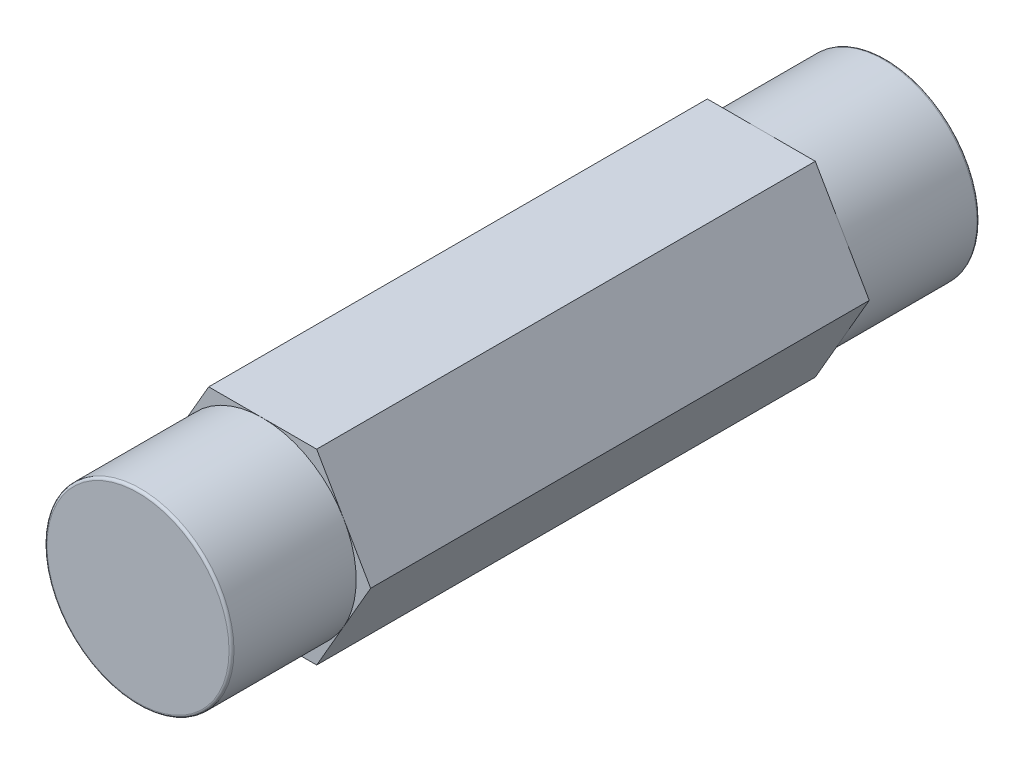
ISO-10303-21;
HEADER;
FILE_DESCRIPTION(('STEP AP214'),'2;1');
FILE_NAME('part.step','',(''),(''),'','','');
FILE_SCHEMA(('AUTOMOTIVE_DESIGN { 1 0 10303 214 1 1 1 1 }'));
ENDSEC;
DATA;
#1=APPLICATION_CONTEXT('core data for automotive mechanical design processes');
#2=APPLICATION_PROTOCOL_DEFINITION('international standard','automotive_design',2000,#1);
#3=PRODUCT_CONTEXT('',#1,'mechanical');
#4=PRODUCT('Part','Part','',(#3));
#5=PRODUCT_RELATED_PRODUCT_CATEGORY('part','',(#4));
#6=PRODUCT_DEFINITION_FORMATION('','',#4);
#7=PRODUCT_DEFINITION_CONTEXT('part definition',#1,'design');
#8=PRODUCT_DEFINITION('design','',#6,#7);
#9=PRODUCT_DEFINITION_SHAPE('','',#8);
#10=(LENGTH_UNIT() NAMED_UNIT(*) SI_UNIT(.MILLI.,.METRE.));
#11=(NAMED_UNIT(*) PLANE_ANGLE_UNIT() SI_UNIT($,.RADIAN.));
#12=(NAMED_UNIT(*) SI_UNIT($,.STERADIAN.) SOLID_ANGLE_UNIT());
#13=UNCERTAINTY_MEASURE_WITH_UNIT(LENGTH_MEASURE(1.E-05),#10,'distance_accuracy_value','');
#14=(GEOMETRIC_REPRESENTATION_CONTEXT(3) GLOBAL_UNCERTAINTY_ASSIGNED_CONTEXT((#13)) GLOBAL_UNIT_ASSIGNED_CONTEXT((#10,
#11,#12)) REPRESENTATION_CONTEXT('',''));
#15=CARTESIAN_POINT('',(0.,0.,0.));
#16=DIRECTION('',(0.,0.,1.));
#17=DIRECTION('',(1.,0.,0.));
#18=AXIS2_PLACEMENT_3D('',#15,#16,#17);
#19=CARTESIAN_POINT('',(5.49926131403119,0.,38.1));
#20=DIRECTION('',(0.,0.,1.));
#21=DIRECTION('',(1.,0.,0.));
#22=AXIS2_PLACEMENT_3D('',#19,#20,#21);
#23=PLANE('',#22);
#24=CARTESIAN_POINT('',(0.,0.,38.1));
#25=DIRECTION('',(0.,0.,-1.));
#26=DIRECTION('',(-1.,0.,0.));
#27=AXIS2_PLACEMENT_3D('',#24,#25,#26);
#28=CIRCLE('',#27,4.6355);
#29=CARTESIAN_POINT('',(-4.6355,0.,38.1));
#30=VERTEX_POINT('',#29);
#31=CARTESIAN_POINT('',(4.6355,0.,38.1));
#32=VERTEX_POINT('',#31);
#33=EDGE_CURVE('E238',#30,#32,#28,.T.);
#34=ORIENTED_EDGE('',*,*,#33,.F.);
#35=CARTESIAN_POINT('',(0.,0.,38.1));
#36=DIRECTION('',(0.,0.,-1.));
#37=DIRECTION('',(1.,0.,0.));
#38=AXIS2_PLACEMENT_3D('',#35,#36,#37);
#39=CIRCLE('',#38,4.6355);
#40=EDGE_CURVE('E241',#32,#30,#39,.T.);
#41=ORIENTED_EDGE('',*,*,#40,.F.);
#42=EDGE_LOOP('',(#34,#41));
#43=FACE_BOUND('',#42,.T.);
#44=ADVANCED_FACE('F16',(#43),#23,.T.);
#45=CARTESIAN_POINT('',(5.49926131403119,0.,0.));
#46=DIRECTION('',(0.,0.,1.));
#47=DIRECTION('',(1.,0.,0.));
#48=AXIS2_PLACEMENT_3D('',#45,#46,#47);
#49=PLANE('',#48);
#50=CARTESIAN_POINT('',(0.,0.,0.));
#51=DIRECTION('',(0.,0.,1.));
#52=DIRECTION('',(1.,0.,0.));
#53=AXIS2_PLACEMENT_3D('',#50,#51,#52);
#54=CIRCLE('',#53,4.6355);
#55=CARTESIAN_POINT('',(4.6355,0.,0.));
#56=VERTEX_POINT('',#55);
#57=CARTESIAN_POINT('',(-4.6355,0.,0.));
#58=VERTEX_POINT('',#57);
#59=EDGE_CURVE('E198',#56,#58,#54,.T.);
#60=ORIENTED_EDGE('',*,*,#59,.F.);
#61=CARTESIAN_POINT('',(0.,0.,0.));
#62=DIRECTION('',(0.,0.,1.));
#63=DIRECTION('',(-1.,0.,0.));
#64=AXIS2_PLACEMENT_3D('',#61,#62,#63);
#65=CIRCLE('',#64,4.6355);
#66=EDGE_CURVE('E295',#58,#56,#65,.T.);
#67=ORIENTED_EDGE('',*,*,#66,.F.);
#68=EDGE_LOOP('',(#60,#67));
#69=FACE_BOUND('',#68,.T.);
#70=ADVANCED_FACE('F306',(#69),#49,.F.);
#71=CARTESIAN_POINT('',(0.,0.,31.75));
#72=DIRECTION('',(0.,0.,1.));
#73=DIRECTION('',(1.,0.,0.));
#74=AXIS2_PLACEMENT_3D('',#71,#72,#73);
#75=PLANE('',#74);
#76=CARTESIAN_POINT('',(0.,0.,31.75));
#77=DIRECTION('',(0.,0.,1.));
#78=DIRECTION('',(1.,0.,0.));
#79=AXIS2_PLACEMENT_3D('',#76,#77,#78);
#80=CIRCLE('',#79,4.7625);
#81=CARTESIAN_POINT('',(-4.1244459855234,2.38125,31.75));
#82=VERTEX_POINT('',#81);
#83=CARTESIAN_POINT('',(-4.1244459855234,-2.38124999999999,31.75));
#84=VERTEX_POINT('',#83);
#85=EDGE_CURVE('E126',#82,#84,#80,.T.);
#86=ORIENTED_EDGE('',*,*,#85,.F.);
#87=DIRECTION('',(0.5,0.866025403784439,0.));
#88=VECTOR('',#87,1.);
#89=CARTESIAN_POINT('',(-2.7496306570156,4.76250000000001,31.75));
#90=LINE('',#89,#88);
#91=CARTESIAN_POINT('',(-5.4992613140312,0.,31.75));
#92=VERTEX_POINT('',#91);
#93=EDGE_CURVE('E293',#82,#92,#90,.F.);
#94=ORIENTED_EDGE('',*,*,#93,.T.);
#95=DIRECTION('',(-0.5,0.866025403784439,0.));
#96=VECTOR('',#95,1.);
#97=CARTESIAN_POINT('',(-5.4992613140312,0.,31.75));
#98=LINE('',#97,#96);
#99=EDGE_CURVE('E188',#92,#84,#98,.F.);
#100=ORIENTED_EDGE('',*,*,#99,.T.);
#101=EDGE_LOOP('',(#86,#94,#100));
#102=FACE_BOUND('',#101,.T.);
#103=ADVANCED_FACE('F271',(#102),#75,.T.);
#104=CARTESIAN_POINT('',(0.,0.,37.973));
#105=DIRECTION('',(0.,0.,1.));
#106=DIRECTION('',(1.,0.,0.));
#107=AXIS2_PLACEMENT_3D('',#104,#105,#106);
#108=TOROIDAL_SURFACE('',#107,4.6355,0.127);
#109=CARTESIAN_POINT('',(0.,0.,37.973));
#110=DIRECTION('',(0.,0.,1.));
#111=DIRECTION('',(1.,0.,0.));
#112=AXIS2_PLACEMENT_3D('',#109,#110,#111);
#113=CIRCLE('',#112,4.7625);
#114=CARTESIAN_POINT('',(4.7625,0.,37.973));
#115=VERTEX_POINT('',#114);
#116=EDGE_CURVE('E140',#115,#115,#113,.F.);
#117=ORIENTED_EDGE('',*,*,#116,.F.);
#118=EDGE_LOOP('',(#117));
#119=FACE_BOUND('',#118,.T.);
#120=ORIENTED_EDGE('',*,*,#40,.T.);
#121=ORIENTED_EDGE('',*,*,#33,.T.);
#122=EDGE_LOOP('',(#120,#121));
#123=FACE_BOUND('',#122,.T.);
#124=ADVANCED_FACE('F240',(#119,#123),#108,.T.);
#125=CARTESIAN_POINT('',(0.,0.,31.75));
#126=DIRECTION('',(0.,0.,1.));
#127=DIRECTION('',(1.,0.,0.));
#128=AXIS2_PLACEMENT_3D('',#125,#126,#127);
#129=PLANE('',#128);
#130=DIRECTION('',(0.5,0.866025403784439,0.));
#131=VECTOR('',#130,1.);
#132=CARTESIAN_POINT('',(-2.7496306570156,4.76250000000001,31.75));
#133=LINE('',#132,#131);
#134=CARTESIAN_POINT('',(-2.7496306570156,4.76250000000001,31.75));
#135=VERTEX_POINT('',#134);
#136=EDGE_CURVE('E123',#135,#82,#133,.F.);
#137=ORIENTED_EDGE('',*,*,#136,.T.);
#138=CARTESIAN_POINT('',(0.,0.,31.75));
#139=DIRECTION('',(0.,0.,1.));
#140=DIRECTION('',(1.,0.,0.));
#141=AXIS2_PLACEMENT_3D('',#138,#139,#140);
#142=CIRCLE('',#141,4.7625);
#143=CARTESIAN_POINT('',(0.,4.76250000000001,31.75));
#144=VERTEX_POINT('',#143);
#145=EDGE_CURVE('E118',#144,#82,#142,.T.);
#146=ORIENTED_EDGE('',*,*,#145,.F.);
#147=DIRECTION('',(1.,0.,0.));
#148=VECTOR('',#147,1.);
#149=CARTESIAN_POINT('',(2.74963065701559,4.76250000000001,31.75));
#150=LINE('',#149,#148);
#151=EDGE_CURVE('E122',#144,#135,#150,.F.);
#152=ORIENTED_EDGE('',*,*,#151,.T.);
#153=EDGE_LOOP('',(#137,#146,#152));
#154=FACE_BOUND('',#153,.T.);
#155=ADVANCED_FACE('F120',(#154),#129,.T.);
#156=CARTESIAN_POINT('',(-2.7496306570156,4.76250000000001,38.1));
#157=DIRECTION('',(0.866025403784439,-0.5,0.));
#158=DIRECTION('',(0.5,0.866025403784439,0.));
#159=AXIS2_PLACEMENT_3D('',#156,#157,#158);
#160=PLANE('',#159);
#161=DIRECTION('',(0.,0.,1.));
#162=VECTOR('',#161,1.);
#163=CARTESIAN_POINT('',(-5.4992613140312,0.,38.1));
#164=LINE('',#163,#162);
#165=CARTESIAN_POINT('',(-5.4992613140312,0.,6.34999999999999));
#166=VERTEX_POINT('',#165);
#167=EDGE_CURVE('E282',#166,#92,#164,.T.);
#168=ORIENTED_EDGE('',*,*,#167,.T.);
#169=ORIENTED_EDGE('',*,*,#93,.F.);
#170=ORIENTED_EDGE('',*,*,#136,.F.);
#171=DIRECTION('',(0.,0.,-1.));
#172=VECTOR('',#171,1.);
#173=CARTESIAN_POINT('',(-2.7496306570156,4.76250000000001,38.1));
#174=LINE('',#173,#172);
#175=CARTESIAN_POINT('',(-2.7496306570156,4.76250000000001,6.35));
#176=VERTEX_POINT('',#175);
#177=EDGE_CURVE('E149',#135,#176,#174,.T.);
#178=ORIENTED_EDGE('',*,*,#177,.T.);
#179=DIRECTION('',(0.499999999999997,0.866025403784441,0.));
#180=VECTOR('',#179,1.);
#181=CARTESIAN_POINT('',(-4.12444598552339,2.38125,6.35));
#182=LINE('',#181,#180);
#183=CARTESIAN_POINT('',(-4.12444598552339,2.38125,6.35));
#184=VERTEX_POINT('',#183);
#185=EDGE_CURVE('E191',#184,#176,#182,.T.);
#186=ORIENTED_EDGE('',*,*,#185,.F.);
#187=DIRECTION('',(0.500000000000003,0.866025403784437,0.));
#188=VECTOR('',#187,1.);
#189=CARTESIAN_POINT('',(-5.4992613140312,0.,6.35));
#190=LINE('',#189,#188);
#191=EDGE_CURVE('E194',#166,#184,#190,.T.);
#192=ORIENTED_EDGE('',*,*,#191,.F.);
#193=EDGE_LOOP('',(#168,#169,#170,#178,#186,#192));
#194=FACE_BOUND('',#193,.T.);
#195=ADVANCED_FACE('F217',(#194),#160,.F.);
#196=CARTESIAN_POINT('',(0.,0.,0.127));
#197=DIRECTION('',(0.,0.,1.));
#198=DIRECTION('',(1.,0.,0.));
#199=AXIS2_PLACEMENT_3D('',#196,#197,#198);
#200=TOROIDAL_SURFACE('',#199,4.6355,0.127);
#201=CARTESIAN_POINT('',(0.,0.,0.127));
#202=DIRECTION('',(0.,0.,-1.));
#203=DIRECTION('',(-1.,0.,0.));
#204=AXIS2_PLACEMENT_3D('',#201,#202,#203);
#205=CIRCLE('',#204,4.7625);
#206=CARTESIAN_POINT('',(-4.7625,0.,0.127));
#207=VERTEX_POINT('',#206);
#208=EDGE_CURVE('E201',#207,#207,#205,.F.);
#209=ORIENTED_EDGE('',*,*,#208,.F.);
#210=EDGE_LOOP('',(#209));
#211=FACE_BOUND('',#210,.T.);
#212=ORIENTED_EDGE('',*,*,#59,.T.);
#213=ORIENTED_EDGE('',*,*,#66,.T.);
#214=EDGE_LOOP('',(#212,#213));
#215=FACE_BOUND('',#214,.T.);
#216=ADVANCED_FACE('F211',(#211,#215),#200,.T.);
#217=CARTESIAN_POINT('',(0.,0.,6.35));
#218=DIRECTION('',(0.,0.,-1.));
#219=DIRECTION('',(-1.,0.,0.));
#220=AXIS2_PLACEMENT_3D('',#217,#218,#219);
#221=PLANE('',#220);
#222=CARTESIAN_POINT('',(0.,0.,6.35));
#223=DIRECTION('',(0.,0.,-1.));
#224=DIRECTION('',(-1.,0.,0.));
#225=AXIS2_PLACEMENT_3D('',#222,#223,#224);
#226=CIRCLE('',#225,4.7625);
#227=CARTESIAN_POINT('',(-4.1244459855234,-2.38125,6.34999999999999));
#228=VERTEX_POINT('',#227);
#229=EDGE_CURVE('E204',#228,#184,#226,.T.);
#230=ORIENTED_EDGE('',*,*,#229,.F.);
#231=DIRECTION('',(-0.5,0.866025403784439,0.));
#232=VECTOR('',#231,1.);
#233=CARTESIAN_POINT('',(-5.4992613140312,0.,6.34999999999999));
#234=LINE('',#233,#232);
#235=EDGE_CURVE('E193',#228,#166,#234,.T.);
#236=ORIENTED_EDGE('',*,*,#235,.T.);
#237=ORIENTED_EDGE('',*,*,#191,.T.);
#238=EDGE_LOOP('',(#230,#236,#237));
#239=FACE_BOUND('',#238,.T.);
#240=ADVANCED_FACE('F216',(#239),#221,.T.);
#241=CARTESIAN_POINT('',(0.,0.,6.35));
#242=DIRECTION('',(0.,0.,-1.));
#243=DIRECTION('',(-1.,0.,0.));
#244=AXIS2_PLACEMENT_3D('',#241,#242,#243);
#245=PLANE('',#244);
#246=CARTESIAN_POINT('',(0.,0.,6.35));
#247=DIRECTION('',(0.,0.,-1.));
#248=DIRECTION('',(-1.,0.,0.));
#249=AXIS2_PLACEMENT_3D('',#246,#247,#248);
#250=CIRCLE('',#249,4.7625);
#251=CARTESIAN_POINT('',(0.,4.76250000000001,6.35));
#252=VERTEX_POINT('',#251);
#253=EDGE_CURVE('E395',#184,#252,#250,.T.);
#254=ORIENTED_EDGE('',*,*,#253,.F.);
#255=ORIENTED_EDGE('',*,*,#185,.T.);
#256=DIRECTION('',(1.,0.,0.));
#257=VECTOR('',#256,1.);
#258=CARTESIAN_POINT('',(2.74963065701559,4.76250000000001,6.35));
#259=LINE('',#258,#257);
#260=EDGE_CURVE('E208',#176,#252,#259,.T.);
#261=ORIENTED_EDGE('',*,*,#260,.T.);
#262=EDGE_LOOP('',(#254,#255,#261));
#263=FACE_BOUND('',#262,.T.);
#264=ADVANCED_FACE('F385',(#263),#245,.T.);
#265=CARTESIAN_POINT('',(0.,0.,6.35));
#266=DIRECTION('',(0.,0.,-1.));
#267=DIRECTION('',(-1.,0.,0.));
#268=AXIS2_PLACEMENT_3D('',#265,#266,#267);
#269=PLANE('',#268);
#270=CARTESIAN_POINT('',(0.,0.,6.35));
#271=DIRECTION('',(0.,0.,-1.));
#272=DIRECTION('',(-1.,0.,0.));
#273=AXIS2_PLACEMENT_3D('',#270,#271,#272);
#274=CIRCLE('',#273,4.7625);
#275=CARTESIAN_POINT('',(0.,-4.76250000000001,6.35));
#276=VERTEX_POINT('',#275);
#277=EDGE_CURVE('E205',#276,#228,#274,.T.);
#278=ORIENTED_EDGE('',*,*,#277,.F.);
#279=DIRECTION('',(1.,0.,0.));
#280=VECTOR('',#279,1.);
#281=CARTESIAN_POINT('',(-2.7496306570156,-4.76250000000001,6.35));
#282=LINE('',#281,#280);
#283=CARTESIAN_POINT('',(-2.7496306570156,-4.76250000000001,6.35));
#284=VERTEX_POINT('',#283);
#285=EDGE_CURVE('E172',#276,#284,#282,.F.);
#286=ORIENTED_EDGE('',*,*,#285,.T.);
#287=DIRECTION('',(-0.5,0.866025403784439,0.));
#288=VECTOR('',#287,1.);
#289=CARTESIAN_POINT('',(-5.4992613140312,0.,6.34999999999999));
#290=LINE('',#289,#288);
#291=EDGE_CURVE('E179',#284,#228,#290,.T.);
#292=ORIENTED_EDGE('',*,*,#291,.T.);
#293=EDGE_LOOP('',(#278,#286,#292));
#294=FACE_BOUND('',#293,.T.);
#295=ADVANCED_FACE('F382',(#294),#269,.T.);
#296=CARTESIAN_POINT('',(-5.4992613140312,0.,38.1));
#297=DIRECTION('',(0.866025403784439,0.5,0.));
#298=DIRECTION('',(-0.5,0.866025403784439,0.));
#299=AXIS2_PLACEMENT_3D('',#296,#297,#298);
#300=PLANE('',#299);
#301=DIRECTION('',(0.,0.,1.));
#302=VECTOR('',#301,1.);
#303=CARTESIAN_POINT('',(-2.7496306570156,-4.76250000000001,38.1));
#304=LINE('',#303,#302);
#305=CARTESIAN_POINT('',(-2.7496306570156,-4.76250000000001,31.75));
#306=VERTEX_POINT('',#305);
#307=EDGE_CURVE('E169',#284,#306,#304,.T.);
#308=ORIENTED_EDGE('',*,*,#307,.T.);
#309=DIRECTION('',(0.499999999999997,-0.866025403784441,0.));
#310=VECTOR('',#309,1.);
#311=CARTESIAN_POINT('',(-4.12444598552339,-2.38125,31.75));
#312=LINE('',#311,#310);
#313=EDGE_CURVE('E127',#84,#306,#312,.T.);
#314=ORIENTED_EDGE('',*,*,#313,.F.);
#315=ORIENTED_EDGE('',*,*,#99,.F.);
#316=ORIENTED_EDGE('',*,*,#167,.F.);
#317=ORIENTED_EDGE('',*,*,#235,.F.);
#318=ORIENTED_EDGE('',*,*,#291,.F.);
#319=EDGE_LOOP('',(#308,#314,#315,#316,#317,#318));
#320=FACE_BOUND('',#319,.T.);
#321=ADVANCED_FACE('F378',(#320),#300,.F.);
#322=CARTESIAN_POINT('',(0.,0.,31.75));
#323=DIRECTION('',(0.,0.,1.));
#324=DIRECTION('',(1.,0.,0.));
#325=AXIS2_PLACEMENT_3D('',#322,#323,#324);
#326=PLANE('',#325);
#327=DIRECTION('',(1.,0.,0.));
#328=VECTOR('',#327,1.);
#329=CARTESIAN_POINT('',(-2.7496306570156,-4.76250000000001,31.75));
#330=LINE('',#329,#328);
#331=CARTESIAN_POINT('',(0.,-4.76250000000001,31.75));
#332=VERTEX_POINT('',#331);
#333=EDGE_CURVE('E165',#306,#332,#330,.T.);
#334=ORIENTED_EDGE('',*,*,#333,.T.);
#335=CARTESIAN_POINT('',(0.,0.,31.75));
#336=DIRECTION('',(0.,0.,1.));
#337=DIRECTION('',(1.,0.,0.));
#338=AXIS2_PLACEMENT_3D('',#335,#336,#337);
#339=CIRCLE('',#338,4.7625);
#340=EDGE_CURVE('E280',#84,#332,#339,.T.);
#341=ORIENTED_EDGE('',*,*,#340,.F.);
#342=ORIENTED_EDGE('',*,*,#313,.T.);
#343=EDGE_LOOP('',(#334,#341,#342));
#344=FACE_BOUND('',#343,.T.);
#345=ADVANCED_FACE('F375',(#344),#326,.T.);
#346=CARTESIAN_POINT('',(0.,0.,31.75));
#347=DIRECTION('',(0.,0.,1.));
#348=DIRECTION('',(1.,0.,0.));
#349=AXIS2_PLACEMENT_3D('',#346,#347,#348);
#350=CYLINDRICAL_SURFACE('',#349,4.7625);
#351=ORIENTED_EDGE('',*,*,#145,.T.);
#352=ORIENTED_EDGE('',*,*,#85,.T.);
#353=ORIENTED_EDGE('',*,*,#340,.T.);
#354=CARTESIAN_POINT('',(0.,0.,31.75));
#355=DIRECTION('',(0.,0.,1.));
#356=DIRECTION('',(1.,0.,0.));
#357=AXIS2_PLACEMENT_3D('',#354,#355,#356);
#358=CIRCLE('',#357,4.7625);
#359=CARTESIAN_POINT('',(4.12444598552339,-2.38125,31.75));
#360=VERTEX_POINT('',#359);
#361=EDGE_CURVE('E426',#360,#332,#358,.F.);
#362=ORIENTED_EDGE('',*,*,#361,.F.);
#363=CARTESIAN_POINT('',(0.,0.,31.75));
#364=DIRECTION('',(0.,0.,1.));
#365=DIRECTION('',(1.,0.,0.));
#366=AXIS2_PLACEMENT_3D('',#363,#364,#365);
#367=CIRCLE('',#366,4.7625);
#368=CARTESIAN_POINT('',(4.12444598552339,2.38125,31.75));
#369=VERTEX_POINT('',#368);
#370=EDGE_CURVE('E134',#369,#360,#367,.F.);
#371=ORIENTED_EDGE('',*,*,#370,.F.);
#372=CARTESIAN_POINT('',(0.,0.,31.75));
#373=DIRECTION('',(0.,0.,1.));
#374=DIRECTION('',(1.,0.,0.));
#375=AXIS2_PLACEMENT_3D('',#372,#373,#374);
#376=CIRCLE('',#375,4.7625);
#377=EDGE_CURVE('E130',#144,#369,#376,.F.);
#378=ORIENTED_EDGE('',*,*,#377,.F.);
#379=EDGE_LOOP('',(#351,#352,#353,#362,#371,#378));
#380=FACE_BOUND('',#379,.T.);
#381=ORIENTED_EDGE('',*,*,#116,.T.);
#382=EDGE_LOOP('',(#381));
#383=FACE_BOUND('',#382,.T.);
#384=ADVANCED_FACE('F131',(#380,#383),#350,.T.);
#385=CARTESIAN_POINT('',(0.,0.,31.75));
#386=DIRECTION('',(0.,0.,1.));
#387=DIRECTION('',(1.,0.,0.));
#388=AXIS2_PLACEMENT_3D('',#385,#386,#387);
#389=PLANE('',#388);
#390=DIRECTION('',(1.,0.,0.));
#391=VECTOR('',#390,1.);
#392=CARTESIAN_POINT('',(2.74963065701559,4.76250000000001,31.75));
#393=LINE('',#392,#391);
#394=CARTESIAN_POINT('',(2.74963065701559,4.76250000000001,31.75));
#395=VERTEX_POINT('',#394);
#396=EDGE_CURVE('E139',#395,#144,#393,.F.);
#397=ORIENTED_EDGE('',*,*,#396,.T.);
#398=ORIENTED_EDGE('',*,*,#377,.T.);
#399=DIRECTION('',(0.500000000000001,-0.866025403784438,0.));
#400=VECTOR('',#399,1.);
#401=CARTESIAN_POINT('',(5.49926131403119,0.,31.75));
#402=LINE('',#401,#400);
#403=EDGE_CURVE('E152',#369,#395,#402,.F.);
#404=ORIENTED_EDGE('',*,*,#403,.T.);
#405=EDGE_LOOP('',(#397,#398,#404));
#406=FACE_BOUND('',#405,.T.);
#407=ADVANCED_FACE('F151',(#406),#389,.T.);
#408=CARTESIAN_POINT('',(2.74963065701559,4.76250000000001,38.1));
#409=DIRECTION('',(0.,-1.,0.));
#410=DIRECTION('',(0.,0.,-1.));
#411=AXIS2_PLACEMENT_3D('',#408,#409,#410);
#412=PLANE('',#411);
#413=ORIENTED_EDGE('',*,*,#177,.F.);
#414=ORIENTED_EDGE('',*,*,#151,.F.);
#415=ORIENTED_EDGE('',*,*,#396,.F.);
#416=DIRECTION('',(0.,0.,1.));
#417=VECTOR('',#416,1.);
#418=CARTESIAN_POINT('',(2.74963065701559,4.76250000000001,38.1));
#419=LINE('',#418,#417);
#420=CARTESIAN_POINT('',(2.74963065701559,4.76250000000001,6.35));
#421=VERTEX_POINT('',#420);
#422=EDGE_CURVE('E161',#395,#421,#419,.F.);
#423=ORIENTED_EDGE('',*,*,#422,.T.);
#424=DIRECTION('',(-1.,0.,0.));
#425=VECTOR('',#424,1.);
#426=CARTESIAN_POINT('',(0.,4.7625,6.35));
#427=LINE('',#426,#425);
#428=EDGE_CURVE('E407',#252,#421,#427,.F.);
#429=ORIENTED_EDGE('',*,*,#428,.F.);
#430=ORIENTED_EDGE('',*,*,#260,.F.);
#431=EDGE_LOOP('',(#413,#414,#415,#423,#429,#430));
#432=FACE_BOUND('',#431,.T.);
#433=ADVANCED_FACE('F144',(#432),#412,.F.);
#434=CARTESIAN_POINT('',(0.,0.,6.35));
#435=DIRECTION('',(0.,0.,-1.));
#436=DIRECTION('',(-1.,0.,0.));
#437=AXIS2_PLACEMENT_3D('',#434,#435,#436);
#438=PLANE('',#437);
#439=DIRECTION('',(0.500000000000001,-0.866025403784438,0.));
#440=VECTOR('',#439,1.);
#441=CARTESIAN_POINT('',(5.49926131403119,0.,6.35));
#442=LINE('',#441,#440);
#443=CARTESIAN_POINT('',(4.12444598552339,2.38125,6.35));
#444=VERTEX_POINT('',#443);
#445=EDGE_CURVE('E444',#421,#444,#442,.T.);
#446=ORIENTED_EDGE('',*,*,#445,.T.);
#447=CARTESIAN_POINT('',(0.,0.,6.35));
#448=DIRECTION('',(0.,0.,-1.));
#449=DIRECTION('',(-1.,0.,0.));
#450=AXIS2_PLACEMENT_3D('',#447,#448,#449);
#451=CIRCLE('',#450,4.7625);
#452=EDGE_CURVE('E400',#252,#444,#451,.T.);
#453=ORIENTED_EDGE('',*,*,#452,.F.);
#454=ORIENTED_EDGE('',*,*,#428,.T.);
#455=EDGE_LOOP('',(#446,#453,#454));
#456=FACE_BOUND('',#455,.T.);
#457=ADVANCED_FACE('F364',(#456),#438,.T.);
#458=CARTESIAN_POINT('',(0.,0.,6.35));
#459=DIRECTION('',(0.,0.,-1.));
#460=DIRECTION('',(-1.,0.,0.));
#461=AXIS2_PLACEMENT_3D('',#458,#459,#460);
#462=CYLINDRICAL_SURFACE('',#461,4.7625);
#463=ORIENTED_EDGE('',*,*,#208,.T.);
#464=EDGE_LOOP('',(#463));
#465=FACE_BOUND('',#464,.T.);
#466=ORIENTED_EDGE('',*,*,#253,.T.);
#467=ORIENTED_EDGE('',*,*,#452,.T.);
#468=CARTESIAN_POINT('',(0.,0.,6.35));
#469=DIRECTION('',(0.,0.,-1.));
#470=DIRECTION('',(-1.,0.,0.));
#471=AXIS2_PLACEMENT_3D('',#468,#469,#470);
#472=CIRCLE('',#471,4.7625);
#473=CARTESIAN_POINT('',(4.12444598552339,-2.38125,6.35));
#474=VERTEX_POINT('',#473);
#475=EDGE_CURVE('E260',#474,#444,#472,.F.);
#476=ORIENTED_EDGE('',*,*,#475,.F.);
#477=CARTESIAN_POINT('',(0.,0.,6.35));
#478=DIRECTION('',(0.,0.,-1.));
#479=DIRECTION('',(-1.,0.,0.));
#480=AXIS2_PLACEMENT_3D('',#477,#478,#479);
#481=CIRCLE('',#480,4.7625);
#482=EDGE_CURVE('E175',#276,#474,#481,.F.);
#483=ORIENTED_EDGE('',*,*,#482,.F.);
#484=ORIENTED_EDGE('',*,*,#277,.T.);
#485=ORIENTED_EDGE('',*,*,#229,.T.);
#486=EDGE_LOOP('',(#466,#467,#476,#483,#484,#485));
#487=FACE_BOUND('',#486,.T.);
#488=ADVANCED_FACE('F360',(#465,#487),#462,.T.);
#489=CARTESIAN_POINT('',(0.,0.,6.35));
#490=DIRECTION('',(0.,0.,-1.));
#491=DIRECTION('',(-1.,0.,0.));
#492=AXIS2_PLACEMENT_3D('',#489,#490,#491);
#493=PLANE('',#492);
#494=DIRECTION('',(1.,0.,0.));
#495=VECTOR('',#494,1.);
#496=CARTESIAN_POINT('',(-2.7496306570156,-4.76250000000001,6.35));
#497=LINE('',#496,#495);
#498=CARTESIAN_POINT('',(2.74963065701559,-4.76250000000001,6.35));
#499=VERTEX_POINT('',#498);
#500=EDGE_CURVE('E168',#499,#276,#497,.F.);
#501=ORIENTED_EDGE('',*,*,#500,.T.);
#502=ORIENTED_EDGE('',*,*,#482,.T.);
#503=DIRECTION('',(-0.5,-0.866025403784439,0.));
#504=VECTOR('',#503,1.);
#505=CARTESIAN_POINT('',(2.74963065701559,-4.76250000000001,6.35));
#506=LINE('',#505,#504);
#507=EDGE_CURVE('E437',#474,#499,#506,.T.);
#508=ORIENTED_EDGE('',*,*,#507,.T.);
#509=EDGE_LOOP('',(#501,#502,#508));
#510=FACE_BOUND('',#509,.T.);
#511=ADVANCED_FACE('F356',(#510),#493,.T.);
#512=CARTESIAN_POINT('',(-2.7496306570156,-4.76250000000001,38.1));
#513=DIRECTION('',(0.,1.,0.));
#514=DIRECTION('',(0.,0.,1.));
#515=AXIS2_PLACEMENT_3D('',#512,#513,#514);
#516=PLANE('',#515);
#517=DIRECTION('',(0.,0.,1.));
#518=VECTOR('',#517,1.);
#519=CARTESIAN_POINT('',(2.74963065701559,-4.76250000000001,38.1));
#520=LINE('',#519,#518);
#521=CARTESIAN_POINT('',(2.74963065701559,-4.76250000000001,31.75));
#522=VERTEX_POINT('',#521);
#523=EDGE_CURVE('E423',#499,#522,#520,.T.);
#524=ORIENTED_EDGE('',*,*,#523,.T.);
#525=DIRECTION('',(1.,0.,0.));
#526=VECTOR('',#525,1.);
#527=CARTESIAN_POINT('',(0.,-4.7625,31.75));
#528=LINE('',#527,#526);
#529=EDGE_CURVE('E421',#332,#522,#528,.T.);
#530=ORIENTED_EDGE('',*,*,#529,.F.);
#531=ORIENTED_EDGE('',*,*,#333,.F.);
#532=ORIENTED_EDGE('',*,*,#307,.F.);
#533=ORIENTED_EDGE('',*,*,#285,.F.);
#534=ORIENTED_EDGE('',*,*,#500,.F.);
#535=EDGE_LOOP('',(#524,#530,#531,#532,#533,#534));
#536=FACE_BOUND('',#535,.T.);
#537=ADVANCED_FACE('F352',(#536),#516,.F.);
#538=CARTESIAN_POINT('',(0.,0.,31.75));
#539=DIRECTION('',(0.,0.,1.));
#540=DIRECTION('',(1.,0.,0.));
#541=AXIS2_PLACEMENT_3D('',#538,#539,#540);
#542=PLANE('',#541);
#543=ORIENTED_EDGE('',*,*,#361,.T.);
#544=ORIENTED_EDGE('',*,*,#529,.T.);
#545=DIRECTION('',(-0.5,-0.866025403784439,0.));
#546=VECTOR('',#545,1.);
#547=CARTESIAN_POINT('',(2.74963065701559,-4.76250000000001,31.75));
#548=LINE('',#547,#546);
#549=EDGE_CURVE('E436',#522,#360,#548,.F.);
#550=ORIENTED_EDGE('',*,*,#549,.T.);
#551=EDGE_LOOP('',(#543,#544,#550));
#552=FACE_BOUND('',#551,.T.);
#553=ADVANCED_FACE('F348',(#552),#542,.T.);
#554=CARTESIAN_POINT('',(0.,0.,31.75));
#555=DIRECTION('',(0.,0.,1.));
#556=DIRECTION('',(1.,0.,0.));
#557=AXIS2_PLACEMENT_3D('',#554,#555,#556);
#558=PLANE('',#557);
#559=DIRECTION('',(0.500000000000001,-0.866025403784438,0.));
#560=VECTOR('',#559,1.);
#561=CARTESIAN_POINT('',(5.49926131403119,0.,31.75));
#562=LINE('',#561,#560);
#563=CARTESIAN_POINT('',(5.49926131403119,0.,31.75));
#564=VERTEX_POINT('',#563);
#565=EDGE_CURVE('E162',#564,#369,#562,.F.);
#566=ORIENTED_EDGE('',*,*,#565,.T.);
#567=ORIENTED_EDGE('',*,*,#370,.T.);
#568=DIRECTION('',(-0.5,-0.866025403784439,0.));
#569=VECTOR('',#568,1.);
#570=CARTESIAN_POINT('',(2.74963065701559,-4.76250000000001,31.75));
#571=LINE('',#570,#569);
#572=EDGE_CURVE('E468',#360,#564,#571,.F.);
#573=ORIENTED_EDGE('',*,*,#572,.T.);
#574=EDGE_LOOP('',(#566,#567,#573));
#575=FACE_BOUND('',#574,.T.);
#576=ADVANCED_FACE('F344',(#575),#558,.T.);
#577=CARTESIAN_POINT('',(5.49926131403119,0.,38.1));
#578=DIRECTION('',(-0.866025403784438,-0.500000000000001,0.));
#579=DIRECTION('',(0.500000000000001,-0.866025403784438,0.));
#580=AXIS2_PLACEMENT_3D('',#577,#578,#579);
#581=PLANE('',#580);
#582=ORIENTED_EDGE('',*,*,#422,.F.);
#583=ORIENTED_EDGE('',*,*,#403,.F.);
#584=ORIENTED_EDGE('',*,*,#565,.F.);
#585=DIRECTION('',(0.,0.,1.));
#586=VECTOR('',#585,1.);
#587=CARTESIAN_POINT('',(5.49926131403119,0.,38.1));
#588=LINE('',#587,#586);
#589=CARTESIAN_POINT('',(5.49926131403119,0.,6.35));
#590=VERTEX_POINT('',#589);
#591=EDGE_CURVE('E28',#564,#590,#588,.F.);
#592=ORIENTED_EDGE('',*,*,#591,.T.);
#593=DIRECTION('',(0.500000000000001,-0.866025403784438,0.));
#594=VECTOR('',#593,1.);
#595=CARTESIAN_POINT('',(4.12444598552339,2.38125,6.35));
#596=LINE('',#595,#594);
#597=EDGE_CURVE('E36',#444,#590,#596,.T.);
#598=ORIENTED_EDGE('',*,*,#597,.F.);
#599=ORIENTED_EDGE('',*,*,#445,.F.);
#600=EDGE_LOOP('',(#582,#583,#584,#592,#598,#599));
#601=FACE_BOUND('',#600,.T.);
#602=ADVANCED_FACE('F338',(#601),#581,.F.);
#603=CARTESIAN_POINT('',(0.,0.,6.35));
#604=DIRECTION('',(0.,0.,-1.));
#605=DIRECTION('',(-1.,0.,0.));
#606=AXIS2_PLACEMENT_3D('',#603,#604,#605);
#607=PLANE('',#606);
#608=DIRECTION('',(-0.5,-0.866025403784439,0.));
#609=VECTOR('',#608,1.);
#610=CARTESIAN_POINT('',(2.74963065701559,-4.76250000000001,6.35));
#611=LINE('',#610,#609);
#612=EDGE_CURVE('E11',#590,#474,#611,.T.);
#613=ORIENTED_EDGE('',*,*,#612,.T.);
#614=ORIENTED_EDGE('',*,*,#475,.T.);
#615=ORIENTED_EDGE('',*,*,#597,.T.);
#616=EDGE_LOOP('',(#613,#614,#615));
#617=FACE_BOUND('',#616,.T.);
#618=ADVANCED_FACE('F332',(#617),#607,.T.);
#619=CARTESIAN_POINT('',(2.74963065701559,-4.76250000000001,38.1));
#620=DIRECTION('',(-0.866025403784439,0.5,0.));
#621=DIRECTION('',(-0.5,-0.866025403784439,0.));
#622=AXIS2_PLACEMENT_3D('',#619,#620,#621);
#623=PLANE('',#622);
#624=ORIENTED_EDGE('',*,*,#591,.F.);
#625=ORIENTED_EDGE('',*,*,#572,.F.);
#626=ORIENTED_EDGE('',*,*,#549,.F.);
#627=ORIENTED_EDGE('',*,*,#523,.F.);
#628=ORIENTED_EDGE('',*,*,#507,.F.);
#629=ORIENTED_EDGE('',*,*,#612,.F.);
#630=EDGE_LOOP('',(#624,#625,#626,#627,#628,#629));
#631=FACE_BOUND('',#630,.T.);
#632=ADVANCED_FACE('F330',(#631),#623,.F.);
#633=CLOSED_SHELL('',(#44,#70,#103,#124,#155,#195,#216,#240,#264,#295,#321,#345,#384,#407,#433,
#457,#488,#511,#537,#553,#576,#602,#618,#632));
#634=MANIFOLD_SOLID_BREP('B1',#633);
#635=ADVANCED_BREP_SHAPE_REPRESENTATION('',(#18,#634),#14);
#636=SHAPE_DEFINITION_REPRESENTATION(#9,#635);
ENDSEC;
END-ISO-10303-21;
